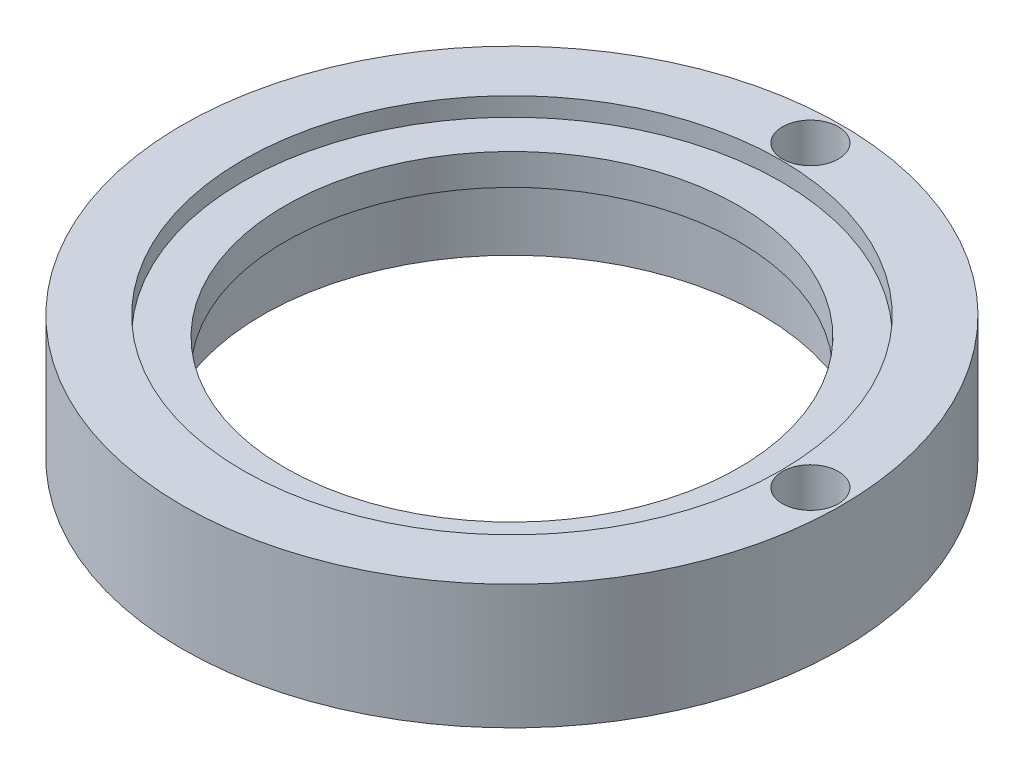
ISO-10303-21;
HEADER;
FILE_DESCRIPTION(('STEP AP214'),'2;1');
FILE_NAME('part.step','',(''),(''),'','','');
FILE_SCHEMA(('AUTOMOTIVE_DESIGN { 1 0 10303 214 1 1 1 1 }'));
ENDSEC;
DATA;
#1=APPLICATION_CONTEXT('core data for automotive mechanical design processes');
#2=APPLICATION_PROTOCOL_DEFINITION('international standard','automotive_design',2000,#1);
#3=PRODUCT_CONTEXT('',#1,'mechanical');
#4=PRODUCT('Part','Part','',(#3));
#5=PRODUCT_RELATED_PRODUCT_CATEGORY('part','',(#4));
#6=PRODUCT_DEFINITION_FORMATION('','',#4);
#7=PRODUCT_DEFINITION_CONTEXT('part definition',#1,'design');
#8=PRODUCT_DEFINITION('design','',#6,#7);
#9=PRODUCT_DEFINITION_SHAPE('','',#8);
#10=(LENGTH_UNIT() NAMED_UNIT(*) SI_UNIT(.MILLI.,.METRE.));
#11=(NAMED_UNIT(*) PLANE_ANGLE_UNIT() SI_UNIT($,.RADIAN.));
#12=(NAMED_UNIT(*) SI_UNIT($,.STERADIAN.) SOLID_ANGLE_UNIT());
#13=UNCERTAINTY_MEASURE_WITH_UNIT(LENGTH_MEASURE(1.E-05),#10,'distance_accuracy_value','');
#14=(GEOMETRIC_REPRESENTATION_CONTEXT(3) GLOBAL_UNCERTAINTY_ASSIGNED_CONTEXT((#13)) GLOBAL_UNIT_ASSIGNED_CONTEXT((#10,
#11,#12)) REPRESENTATION_CONTEXT('',''));
#15=CARTESIAN_POINT('',(0.,0.,0.));
#16=DIRECTION('',(0.,0.,1.));
#17=DIRECTION('',(1.,0.,0.));
#18=AXIS2_PLACEMENT_3D('',#15,#16,#17);
#19=CARTESIAN_POINT('',(0.,20.,0.));
#20=DIRECTION('',(0.,-1.,0.));
#21=DIRECTION('',(0.,0.,-1.));
#22=AXIS2_PLACEMENT_3D('',#19,#20,#21);
#23=CYLINDRICAL_SURFACE('',#22,36.5);
#24=CARTESIAN_POINT('',(0.,12.,0.));
#25=DIRECTION('',(0.,1.,0.));
#26=DIRECTION('',(0.,0.,1.));
#27=AXIS2_PLACEMENT_3D('',#24,#25,#26);
#28=CIRCLE('',#27,36.5);
#29=CARTESIAN_POINT('',(0.,12.,36.5));
#30=VERTEX_POINT('',#29);
#31=EDGE_CURVE('E45',#30,#30,#28,.T.);
#32=ORIENTED_EDGE('',*,*,#31,.F.);
#33=EDGE_LOOP('',(#32));
#34=FACE_BOUND('',#33,.T.);
#35=CARTESIAN_POINT('',(0.,17.,0.));
#36=DIRECTION('',(0.,1.,0.));
#37=DIRECTION('',(0.,0.,1.));
#38=AXIS2_PLACEMENT_3D('',#35,#36,#37);
#39=CIRCLE('',#38,36.5);
#40=CARTESIAN_POINT('',(0.,17.,36.5));
#41=VERTEX_POINT('',#40);
#42=EDGE_CURVE('E55',#41,#41,#39,.T.);
#43=ORIENTED_EDGE('',*,*,#42,.T.);
#44=EDGE_LOOP('',(#43));
#45=FACE_BOUND('',#44,.T.);
#46=ADVANCED_FACE('F41',(#34,#45),#23,.F.);
#47=CARTESIAN_POINT('',(0.,20.,0.));
#48=DIRECTION('',(0.,1.,0.));
#49=DIRECTION('',(0.,0.,1.));
#50=AXIS2_PLACEMENT_3D('',#47,#48,#49);
#51=PLANE('',#50);
#52=CARTESIAN_POINT('',(0.,20.,-48.));
#53=DIRECTION('',(0.,1.,0.));
#54=DIRECTION('',(0.,0.,1.));
#55=AXIS2_PLACEMENT_3D('',#52,#53,#54);
#56=CIRCLE('',#55,4.5);
#57=CARTESIAN_POINT('',(0.,20.,-43.5));
#58=VERTEX_POINT('',#57);
#59=EDGE_CURVE('E92',#58,#58,#56,.T.);
#60=ORIENTED_EDGE('',*,*,#59,.F.);
#61=EDGE_LOOP('',(#60));
#62=FACE_BOUND('',#61,.T.);
#63=CARTESIAN_POINT('',(48.,20.,0.));
#64=DIRECTION('',(0.,1.,0.));
#65=DIRECTION('',(0.,0.,1.));
#66=AXIS2_PLACEMENT_3D('',#63,#64,#65);
#67=CIRCLE('',#66,4.5);
#68=CARTESIAN_POINT('',(48.,20.,4.5));
#69=VERTEX_POINT('',#68);
#70=EDGE_CURVE('E84',#69,#69,#67,.T.);
#71=ORIENTED_EDGE('',*,*,#70,.F.);
#72=EDGE_LOOP('',(#71));
#73=FACE_BOUND('',#72,.T.);
#74=CARTESIAN_POINT('',(0.,20.,0.));
#75=DIRECTION('',(0.,1.,0.));
#76=DIRECTION('',(0.,0.,1.));
#77=AXIS2_PLACEMENT_3D('',#74,#75,#76);
#78=CIRCLE('',#77,43.25);
#79=CARTESIAN_POINT('',(0.,20.,43.25));
#80=VERTEX_POINT('',#79);
#81=EDGE_CURVE('E58',#80,#80,#78,.T.);
#82=ORIENTED_EDGE('',*,*,#81,.F.);
#83=EDGE_LOOP('',(#82));
#84=FACE_BOUND('',#83,.T.);
#85=CARTESIAN_POINT('',(0.,20.,0.));
#86=DIRECTION('',(0.,1.,0.));
#87=DIRECTION('',(0.,0.,1.));
#88=AXIS2_PLACEMENT_3D('',#85,#86,#87);
#89=CIRCLE('',#88,53.);
#90=CARTESIAN_POINT('',(0.,20.,53.));
#91=VERTEX_POINT('',#90);
#92=EDGE_CURVE('E11',#91,#91,#89,.T.);
#93=ORIENTED_EDGE('',*,*,#92,.T.);
#94=EDGE_LOOP('',(#93));
#95=FACE_BOUND('',#94,.T.);
#96=ADVANCED_FACE('F111',(#62,#73,#84,#95),#51,.T.);
#97=CARTESIAN_POINT('',(0.,0.,0.));
#98=DIRECTION('',(0.,1.,0.));
#99=DIRECTION('',(0.,0.,1.));
#100=AXIS2_PLACEMENT_3D('',#97,#98,#99);
#101=PLANE('',#100);
#102=CARTESIAN_POINT('',(0.,0.,-48.));
#103=DIRECTION('',(0.,1.,0.));
#104=DIRECTION('',(0.,0.,1.));
#105=AXIS2_PLACEMENT_3D('',#102,#103,#104);
#106=CIRCLE('',#105,4.5);
#107=CARTESIAN_POINT('',(0.,0.,-43.5));
#108=VERTEX_POINT('',#107);
#109=EDGE_CURVE('E83',#108,#108,#106,.T.);
#110=ORIENTED_EDGE('',*,*,#109,.T.);
#111=EDGE_LOOP('',(#110));
#112=FACE_BOUND('',#111,.T.);
#113=CARTESIAN_POINT('',(48.,0.,0.));
#114=DIRECTION('',(0.,1.,0.));
#115=DIRECTION('',(0.,0.,1.));
#116=AXIS2_PLACEMENT_3D('',#113,#114,#115);
#117=CIRCLE('',#116,4.5);
#118=CARTESIAN_POINT('',(48.,0.,4.5));
#119=VERTEX_POINT('',#118);
#120=EDGE_CURVE('E88',#119,#119,#117,.T.);
#121=ORIENTED_EDGE('',*,*,#120,.T.);
#122=EDGE_LOOP('',(#121));
#123=FACE_BOUND('',#122,.T.);
#124=CARTESIAN_POINT('',(0.,0.,0.));
#125=DIRECTION('',(0.,-1.,0.));
#126=DIRECTION('',(0.,0.,-1.));
#127=AXIS2_PLACEMENT_3D('',#124,#125,#126);
#128=CIRCLE('',#127,40.1);
#129=CARTESIAN_POINT('',(0.,0.,-40.1));
#130=VERTEX_POINT('',#129);
#131=EDGE_CURVE('E79',#130,#130,#128,.T.);
#132=ORIENTED_EDGE('',*,*,#131,.F.);
#133=EDGE_LOOP('',(#132));
#134=FACE_BOUND('',#133,.T.);
#135=CARTESIAN_POINT('',(0.,0.,0.));
#136=DIRECTION('',(0.,1.,0.));
#137=DIRECTION('',(0.,0.,1.));
#138=AXIS2_PLACEMENT_3D('',#135,#136,#137);
#139=CIRCLE('',#138,53.);
#140=CARTESIAN_POINT('',(0.,0.,53.));
#141=VERTEX_POINT('',#140);
#142=EDGE_CURVE('E49',#141,#141,#139,.T.);
#143=ORIENTED_EDGE('',*,*,#142,.F.);
#144=EDGE_LOOP('',(#143));
#145=FACE_BOUND('',#144,.T.);
#146=ADVANCED_FACE('F101',(#112,#123,#134,#145),#101,.F.);
#147=CARTESIAN_POINT('',(0.,20.,0.));
#148=DIRECTION('',(0.,-1.,0.));
#149=DIRECTION('',(0.,0.,-1.));
#150=AXIS2_PLACEMENT_3D('',#147,#148,#149);
#151=CYLINDRICAL_SURFACE('',#150,53.);
#152=ORIENTED_EDGE('',*,*,#92,.F.);
#153=EDGE_LOOP('',(#152));
#154=FACE_BOUND('',#153,.T.);
#155=ORIENTED_EDGE('',*,*,#142,.T.);
#156=EDGE_LOOP('',(#155));
#157=FACE_BOUND('',#156,.T.);
#158=ADVANCED_FACE('F43',(#154,#157),#151,.T.);
#159=CARTESIAN_POINT('',(0.,17.,0.));
#160=DIRECTION('',(0.,1.,0.));
#161=DIRECTION('',(0.,0.,1.));
#162=AXIS2_PLACEMENT_3D('',#159,#160,#161);
#163=CYLINDRICAL_SURFACE('',#162,43.25);
#164=CARTESIAN_POINT('',(0.,17.,0.));
#165=DIRECTION('',(0.,1.,0.));
#166=DIRECTION('',(0.,0.,1.));
#167=AXIS2_PLACEMENT_3D('',#164,#165,#166);
#168=CIRCLE('',#167,43.25);
#169=CARTESIAN_POINT('',(0.,17.,43.25));
#170=VERTEX_POINT('',#169);
#171=EDGE_CURVE('E62',#170,#170,#168,.T.);
#172=ORIENTED_EDGE('',*,*,#171,.F.);
#173=EDGE_LOOP('',(#172));
#174=FACE_BOUND('',#173,.T.);
#175=ORIENTED_EDGE('',*,*,#81,.T.);
#176=EDGE_LOOP('',(#175));
#177=FACE_BOUND('',#176,.T.);
#178=ADVANCED_FACE('F119',(#174,#177),#163,.F.);
#179=CARTESIAN_POINT('',(0.,17.,0.));
#180=DIRECTION('',(0.,1.,0.));
#181=DIRECTION('',(0.,0.,1.));
#182=AXIS2_PLACEMENT_3D('',#179,#180,#181);
#183=PLANE('',#182);
#184=ORIENTED_EDGE('',*,*,#42,.F.);
#185=EDGE_LOOP('',(#184));
#186=FACE_BOUND('',#185,.T.);
#187=ORIENTED_EDGE('',*,*,#171,.T.);
#188=EDGE_LOOP('',(#187));
#189=FACE_BOUND('',#188,.T.);
#190=ADVANCED_FACE('F121',(#186,#189),#183,.T.);
#191=CARTESIAN_POINT('',(0.,12.,0.));
#192=DIRECTION('',(0.,1.,0.));
#193=DIRECTION('',(0.,0.,1.));
#194=AXIS2_PLACEMENT_3D('',#191,#192,#193);
#195=PLANE('',#194);
#196=ORIENTED_EDGE('',*,*,#31,.T.);
#197=EDGE_LOOP('',(#196));
#198=FACE_BOUND('',#197,.T.);
#199=CARTESIAN_POINT('',(0.,12.,0.));
#200=DIRECTION('',(0.,1.,0.));
#201=DIRECTION('',(0.,0.,1.));
#202=AXIS2_PLACEMENT_3D('',#199,#200,#201);
#203=CIRCLE('',#202,40.1);
#204=CARTESIAN_POINT('',(0.,12.,40.1));
#205=VERTEX_POINT('',#204);
#206=EDGE_CURVE('E75',#205,#205,#203,.F.);
#207=ORIENTED_EDGE('',*,*,#206,.T.);
#208=EDGE_LOOP('',(#207));
#209=FACE_BOUND('',#208,.T.);
#210=ADVANCED_FACE('F128',(#198,#209),#195,.F.);
#211=CARTESIAN_POINT('',(0.,130.419927702322,0.));
#212=DIRECTION('',(0.,-1.,0.));
#213=DIRECTION('',(0.,0.,-1.));
#214=AXIS2_PLACEMENT_3D('',#211,#212,#213);
#215=CYLINDRICAL_SURFACE('',#214,40.1);
#216=ORIENTED_EDGE('',*,*,#131,.T.);
#217=EDGE_LOOP('',(#216));
#218=FACE_BOUND('',#217,.T.);
#219=ORIENTED_EDGE('',*,*,#206,.F.);
#220=EDGE_LOOP('',(#219));
#221=FACE_BOUND('',#220,.T.);
#222=ADVANCED_FACE('F177',(#218,#221),#215,.F.);
#223=CARTESIAN_POINT('',(48.,0.,0.));
#224=DIRECTION('',(0.,1.,0.));
#225=DIRECTION('',(0.,0.,1.));
#226=AXIS2_PLACEMENT_3D('',#223,#224,#225);
#227=CYLINDRICAL_SURFACE('',#226,4.5);
#228=ORIENTED_EDGE('',*,*,#120,.F.);
#229=EDGE_LOOP('',(#228));
#230=FACE_BOUND('',#229,.T.);
#231=ORIENTED_EDGE('',*,*,#70,.T.);
#232=EDGE_LOOP('',(#231));
#233=FACE_BOUND('',#232,.T.);
#234=ADVANCED_FACE('F107',(#230,#233),#227,.F.);
#235=CARTESIAN_POINT('',(0.,0.,-48.));
#236=DIRECTION('',(0.,1.,0.));
#237=DIRECTION('',(0.,0.,1.));
#238=AXIS2_PLACEMENT_3D('',#235,#236,#237);
#239=CYLINDRICAL_SURFACE('',#238,4.5);
#240=ORIENTED_EDGE('',*,*,#109,.F.);
#241=EDGE_LOOP('',(#240));
#242=FACE_BOUND('',#241,.T.);
#243=ORIENTED_EDGE('',*,*,#59,.T.);
#244=EDGE_LOOP('',(#243));
#245=FACE_BOUND('',#244,.T.);
#246=ADVANCED_FACE('F104',(#242,#245),#239,.F.);
#247=CLOSED_SHELL('',(#46,#96,#146,#158,#178,#190,#210,#222,#234,#246));
#248=MANIFOLD_SOLID_BREP('B2',#247);
#249=ADVANCED_BREP_SHAPE_REPRESENTATION('',(#18,#248),#14);
#250=SHAPE_DEFINITION_REPRESENTATION(#9,#249);
ENDSEC;
END-ISO-10303-21;
